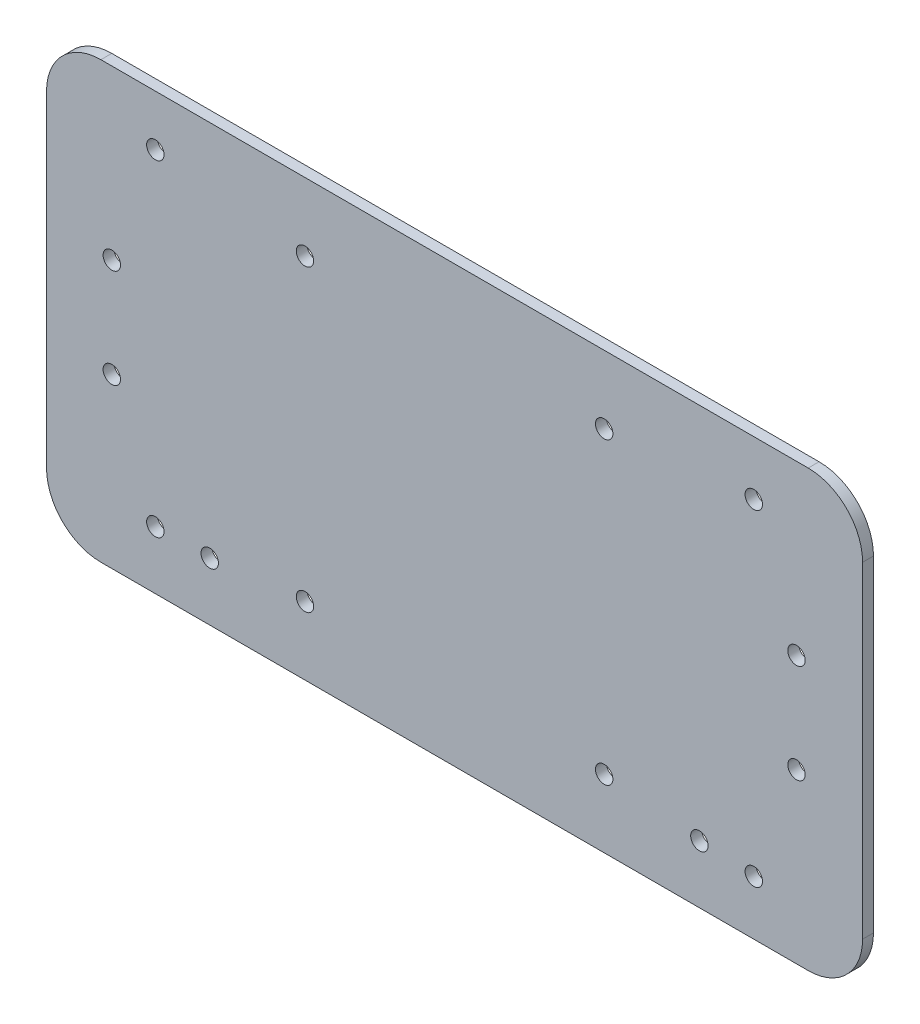
ISO-10303-21;
HEADER;
FILE_DESCRIPTION(('STEP AP214'),'2;1');
FILE_NAME('part.step','',(''),(''),'','','');
FILE_SCHEMA(('AUTOMOTIVE_DESIGN { 1 0 10303 214 1 1 1 1 }'));
ENDSEC;
DATA;
#1=APPLICATION_CONTEXT('core data for automotive mechanical design processes');
#2=APPLICATION_PROTOCOL_DEFINITION('international standard','automotive_design',2000,#1);
#3=PRODUCT_CONTEXT('',#1,'mechanical');
#4=PRODUCT('Part','Part','',(#3));
#5=PRODUCT_RELATED_PRODUCT_CATEGORY('part','',(#4));
#6=PRODUCT_DEFINITION_FORMATION('','',#4);
#7=PRODUCT_DEFINITION_CONTEXT('part definition',#1,'design');
#8=PRODUCT_DEFINITION('design','',#6,#7);
#9=PRODUCT_DEFINITION_SHAPE('','',#8);
#10=(LENGTH_UNIT() NAMED_UNIT(*) SI_UNIT(.MILLI.,.METRE.));
#11=(NAMED_UNIT(*) PLANE_ANGLE_UNIT() SI_UNIT($,.RADIAN.));
#12=(NAMED_UNIT(*) SI_UNIT($,.STERADIAN.) SOLID_ANGLE_UNIT());
#13=UNCERTAINTY_MEASURE_WITH_UNIT(LENGTH_MEASURE(1.E-05),#10,'distance_accuracy_value','');
#14=(GEOMETRIC_REPRESENTATION_CONTEXT(3) GLOBAL_UNCERTAINTY_ASSIGNED_CONTEXT((#13)) GLOBAL_UNIT_ASSIGNED_CONTEXT((#10,
#11,#12)) REPRESENTATION_CONTEXT('',''));
#15=CARTESIAN_POINT('',(0.,0.,0.));
#16=DIRECTION('',(0.,0.,1.));
#17=DIRECTION('',(1.,0.,0.));
#18=AXIS2_PLACEMENT_3D('',#15,#16,#17);
#19=CARTESIAN_POINT('',(75.,0.,2.));
#20=DIRECTION('',(-1.,0.,0.));
#21=DIRECTION('',(0.,-1.,0.));
#22=AXIS2_PLACEMENT_3D('',#19,#20,#21);
#23=PLANE('',#22);
#24=DIRECTION('',(0.,1.,0.));
#25=VECTOR('',#24,1.);
#26=CARTESIAN_POINT('',(75.,0.,0.));
#27=LINE('',#26,#25);
#28=CARTESIAN_POINT('',(75.,-29.9999999999999,0.));
#29=VERTEX_POINT('',#28);
#30=CARTESIAN_POINT('',(75.,29.9999999999999,0.));
#31=VERTEX_POINT('',#30);
#32=EDGE_CURVE('E179',#29,#31,#27,.T.);
#33=ORIENTED_EDGE('',*,*,#32,.T.);
#34=DIRECTION('',(0.,0.,-1.));
#35=VECTOR('',#34,1.);
#36=CARTESIAN_POINT('',(75.,29.9999999999999,2.));
#37=LINE('',#36,#35);
#38=CARTESIAN_POINT('',(75.,29.9999999999999,2.));
#39=VERTEX_POINT('',#38);
#40=EDGE_CURVE('E11',#39,#31,#37,.T.);
#41=ORIENTED_EDGE('',*,*,#40,.F.);
#42=DIRECTION('',(0.,1.,0.));
#43=VECTOR('',#42,1.);
#44=CARTESIAN_POINT('',(75.,0.,2.));
#45=LINE('',#44,#43);
#46=CARTESIAN_POINT('',(75.,-29.9999999999999,2.));
#47=VERTEX_POINT('',#46);
#48=EDGE_CURVE('E251',#47,#39,#45,.T.);
#49=ORIENTED_EDGE('',*,*,#48,.F.);
#50=DIRECTION('',(0.,0.,-1.));
#51=VECTOR('',#50,1.);
#52=CARTESIAN_POINT('',(75.,-29.9999999999999,2.));
#53=LINE('',#52,#51);
#54=EDGE_CURVE('E163',#47,#29,#53,.T.);
#55=ORIENTED_EDGE('',*,*,#54,.T.);
#56=EDGE_LOOP('',(#33,#41,#49,#55));
#57=FACE_BOUND('',#56,.T.);
#58=ADVANCED_FACE('F39',(#57),#23,.F.);
#59=CARTESIAN_POINT('',(65.,30.,2.));
#60=DIRECTION('',(0.,0.,-1.));
#61=DIRECTION('',(-1.,0.,0.));
#62=AXIS2_PLACEMENT_3D('',#59,#60,#61);
#63=CYLINDRICAL_SURFACE('',#62,10.);
#64=CARTESIAN_POINT('',(65.,30.,0.));
#65=DIRECTION('',(0.,0.,1.));
#66=DIRECTION('',(1.,0.,0.));
#67=AXIS2_PLACEMENT_3D('',#64,#65,#66);
#68=CIRCLE('',#67,10.);
#69=CARTESIAN_POINT('',(64.9999999999999,40.,0.));
#70=VERTEX_POINT('',#69);
#71=EDGE_CURVE('E182',#31,#70,#68,.T.);
#72=ORIENTED_EDGE('',*,*,#71,.T.);
#73=DIRECTION('',(0.,0.,-1.));
#74=VECTOR('',#73,1.);
#75=CARTESIAN_POINT('',(64.9999999999999,40.,2.));
#76=LINE('',#75,#74);
#77=CARTESIAN_POINT('',(64.9999999999999,40.,2.));
#78=VERTEX_POINT('',#77);
#79=EDGE_CURVE('E48',#78,#70,#76,.T.);
#80=ORIENTED_EDGE('',*,*,#79,.F.);
#81=CARTESIAN_POINT('',(65.,30.,2.));
#82=DIRECTION('',(0.,0.,1.));
#83=DIRECTION('',(1.,0.,0.));
#84=AXIS2_PLACEMENT_3D('',#81,#82,#83);
#85=CIRCLE('',#84,10.);
#86=EDGE_CURVE('E99',#39,#78,#85,.T.);
#87=ORIENTED_EDGE('',*,*,#86,.F.);
#88=ORIENTED_EDGE('',*,*,#40,.T.);
#89=EDGE_LOOP('',(#72,#80,#87,#88));
#90=FACE_BOUND('',#89,.T.);
#91=ADVANCED_FACE('F237',(#90),#63,.T.);
#92=CARTESIAN_POINT('',(0.,40.,2.));
#93=DIRECTION('',(0.,1.,0.));
#94=DIRECTION('',(0.,0.,1.));
#95=AXIS2_PLACEMENT_3D('',#92,#93,#94);
#96=PLANE('',#95);
#97=DIRECTION('',(1.,0.,0.));
#98=VECTOR('',#97,1.);
#99=CARTESIAN_POINT('',(0.,40.,0.));
#100=LINE('',#99,#98);
#101=CARTESIAN_POINT('',(-64.9999999999999,40.,0.));
#102=VERTEX_POINT('',#101);
#103=EDGE_CURVE('E185',#102,#70,#100,.T.);
#104=ORIENTED_EDGE('',*,*,#103,.F.);
#105=DIRECTION('',(0.,0.,-1.));
#106=VECTOR('',#105,1.);
#107=CARTESIAN_POINT('',(-64.9999999999999,40.,2.));
#108=LINE('',#107,#106);
#109=CARTESIAN_POINT('',(-64.9999999999999,40.,2.));
#110=VERTEX_POINT('',#109);
#111=EDGE_CURVE('E230',#110,#102,#108,.T.);
#112=ORIENTED_EDGE('',*,*,#111,.F.);
#113=DIRECTION('',(1.,0.,0.));
#114=VECTOR('',#113,1.);
#115=CARTESIAN_POINT('',(0.,40.,2.));
#116=LINE('',#115,#114);
#117=EDGE_CURVE('E236',#110,#78,#116,.T.);
#118=ORIENTED_EDGE('',*,*,#117,.T.);
#119=ORIENTED_EDGE('',*,*,#79,.T.);
#120=EDGE_LOOP('',(#104,#112,#118,#119));
#121=FACE_BOUND('',#120,.T.);
#122=ADVANCED_FACE('F234',(#121),#96,.T.);
#123=CARTESIAN_POINT('',(-65.,30.,2.));
#124=DIRECTION('',(0.,0.,-1.));
#125=DIRECTION('',(-1.,0.,0.));
#126=AXIS2_PLACEMENT_3D('',#123,#124,#125);
#127=CYLINDRICAL_SURFACE('',#126,10.);
#128=CARTESIAN_POINT('',(-65.,30.,0.));
#129=DIRECTION('',(0.,0.,1.));
#130=DIRECTION('',(1.,0.,0.));
#131=AXIS2_PLACEMENT_3D('',#128,#129,#130);
#132=CIRCLE('',#131,10.);
#133=CARTESIAN_POINT('',(-75.,29.9999999999999,0.));
#134=VERTEX_POINT('',#133);
#135=EDGE_CURVE('E188',#134,#102,#132,.F.);
#136=ORIENTED_EDGE('',*,*,#135,.F.);
#137=DIRECTION('',(0.,0.,-1.));
#138=VECTOR('',#137,1.);
#139=CARTESIAN_POINT('',(-75.,29.9999999999999,2.));
#140=LINE('',#139,#138);
#141=CARTESIAN_POINT('',(-75.,29.9999999999999,2.));
#142=VERTEX_POINT('',#141);
#143=EDGE_CURVE('E228',#142,#134,#140,.T.);
#144=ORIENTED_EDGE('',*,*,#143,.F.);
#145=CARTESIAN_POINT('',(-65.,30.,2.));
#146=DIRECTION('',(0.,0.,1.));
#147=DIRECTION('',(1.,0.,0.));
#148=AXIS2_PLACEMENT_3D('',#145,#146,#147);
#149=CIRCLE('',#148,10.);
#150=EDGE_CURVE('E248',#142,#110,#149,.F.);
#151=ORIENTED_EDGE('',*,*,#150,.T.);
#152=ORIENTED_EDGE('',*,*,#111,.T.);
#153=EDGE_LOOP('',(#136,#144,#151,#152));
#154=FACE_BOUND('',#153,.T.);
#155=ADVANCED_FACE('F246',(#154),#127,.T.);
#156=CARTESIAN_POINT('',(-75.,0.,2.));
#157=DIRECTION('',(-1.,0.,0.));
#158=DIRECTION('',(0.,0.,1.));
#159=AXIS2_PLACEMENT_3D('',#156,#157,#158);
#160=PLANE('',#159);
#161=DIRECTION('',(0.,1.,0.));
#162=VECTOR('',#161,1.);
#163=CARTESIAN_POINT('',(-75.,0.,0.));
#164=LINE('',#163,#162);
#165=CARTESIAN_POINT('',(-75.,-29.9999999999999,0.));
#166=VERTEX_POINT('',#165);
#167=EDGE_CURVE('E191',#166,#134,#164,.T.);
#168=ORIENTED_EDGE('',*,*,#167,.F.);
#169=DIRECTION('',(0.,0.,-1.));
#170=VECTOR('',#169,1.);
#171=CARTESIAN_POINT('',(-75.,-29.9999999999999,2.));
#172=LINE('',#171,#170);
#173=CARTESIAN_POINT('',(-75.,-29.9999999999999,2.));
#174=VERTEX_POINT('',#173);
#175=EDGE_CURVE('E128',#174,#166,#172,.T.);
#176=ORIENTED_EDGE('',*,*,#175,.F.);
#177=DIRECTION('',(0.,1.,0.));
#178=VECTOR('',#177,1.);
#179=CARTESIAN_POINT('',(-75.,0.,2.));
#180=LINE('',#179,#178);
#181=EDGE_CURVE('E121',#174,#142,#180,.T.);
#182=ORIENTED_EDGE('',*,*,#181,.T.);
#183=ORIENTED_EDGE('',*,*,#143,.T.);
#184=EDGE_LOOP('',(#168,#176,#182,#183));
#185=FACE_BOUND('',#184,.T.);
#186=ADVANCED_FACE('F255',(#185),#160,.T.);
#187=CARTESIAN_POINT('',(-65.,-30.,2.));
#188=DIRECTION('',(0.,0.,-1.));
#189=DIRECTION('',(-1.,0.,0.));
#190=AXIS2_PLACEMENT_3D('',#187,#188,#189);
#191=CYLINDRICAL_SURFACE('',#190,10.);
#192=CARTESIAN_POINT('',(-65.,-30.,0.));
#193=DIRECTION('',(0.,0.,1.));
#194=DIRECTION('',(1.,0.,0.));
#195=AXIS2_PLACEMENT_3D('',#192,#193,#194);
#196=CIRCLE('',#195,10.);
#197=CARTESIAN_POINT('',(-64.9999999999999,-40.,0.));
#198=VERTEX_POINT('',#197);
#199=EDGE_CURVE('E127',#166,#198,#196,.T.);
#200=ORIENTED_EDGE('',*,*,#199,.T.);
#201=DIRECTION('',(0.,0.,-1.));
#202=VECTOR('',#201,1.);
#203=CARTESIAN_POINT('',(-64.9999999999999,-40.,2.));
#204=LINE('',#203,#202);
#205=CARTESIAN_POINT('',(-64.9999999999999,-40.,2.));
#206=VERTEX_POINT('',#205);
#207=EDGE_CURVE('E124',#206,#198,#204,.T.);
#208=ORIENTED_EDGE('',*,*,#207,.F.);
#209=CARTESIAN_POINT('',(-65.,-30.,2.));
#210=DIRECTION('',(0.,0.,1.));
#211=DIRECTION('',(1.,0.,0.));
#212=AXIS2_PLACEMENT_3D('',#209,#210,#211);
#213=CIRCLE('',#212,10.);
#214=EDGE_CURVE('E113',#174,#206,#213,.T.);
#215=ORIENTED_EDGE('',*,*,#214,.F.);
#216=ORIENTED_EDGE('',*,*,#175,.T.);
#217=EDGE_LOOP('',(#200,#208,#215,#216));
#218=FACE_BOUND('',#217,.T.);
#219=ADVANCED_FACE('F125',(#218),#191,.T.);
#220=CARTESIAN_POINT('',(0.,-40.,2.));
#221=DIRECTION('',(0.,1.,0.));
#222=DIRECTION('',(0.,0.,1.));
#223=AXIS2_PLACEMENT_3D('',#220,#221,#222);
#224=PLANE('',#223);
#225=DIRECTION('',(1.,0.,0.));
#226=VECTOR('',#225,1.);
#227=CARTESIAN_POINT('',(0.,-40.,0.));
#228=LINE('',#227,#226);
#229=CARTESIAN_POINT('',(64.9999999999999,-40.,0.));
#230=VERTEX_POINT('',#229);
#231=EDGE_CURVE('E85',#198,#230,#228,.T.);
#232=ORIENTED_EDGE('',*,*,#231,.T.);
#233=DIRECTION('',(0.,0.,-1.));
#234=VECTOR('',#233,1.);
#235=CARTESIAN_POINT('',(64.9999999999999,-40.,2.));
#236=LINE('',#235,#234);
#237=CARTESIAN_POINT('',(64.9999999999999,-40.,2.));
#238=VERTEX_POINT('',#237);
#239=EDGE_CURVE('E129',#238,#230,#236,.T.);
#240=ORIENTED_EDGE('',*,*,#239,.F.);
#241=DIRECTION('',(1.,0.,0.));
#242=VECTOR('',#241,1.);
#243=CARTESIAN_POINT('',(0.,-40.,2.));
#244=LINE('',#243,#242);
#245=EDGE_CURVE('E118',#206,#238,#244,.T.);
#246=ORIENTED_EDGE('',*,*,#245,.F.);
#247=ORIENTED_EDGE('',*,*,#207,.T.);
#248=EDGE_LOOP('',(#232,#240,#246,#247));
#249=FACE_BOUND('',#248,.T.);
#250=ADVANCED_FACE('F131',(#249),#224,.F.);
#251=CARTESIAN_POINT('',(-55.,30.6666666666667,2.));
#252=DIRECTION('',(0.,0.,-1.));
#253=DIRECTION('',(-1.,0.,0.));
#254=AXIS2_PLACEMENT_3D('',#251,#252,#253);
#255=CYLINDRICAL_SURFACE('',#254,1.6);
#256=CARTESIAN_POINT('',(-55.,30.6666666666667,2.));
#257=DIRECTION('',(0.,0.,1.));
#258=DIRECTION('',(1.,0.,0.));
#259=AXIS2_PLACEMENT_3D('',#256,#257,#258);
#260=CIRCLE('',#259,1.6);
#261=CARTESIAN_POINT('',(-53.4,30.6666666666667,2.));
#262=VERTEX_POINT('',#261);
#263=EDGE_CURVE('E157',#262,#262,#260,.T.);
#264=ORIENTED_EDGE('',*,*,#263,.T.);
#265=EDGE_LOOP('',(#264));
#266=FACE_BOUND('',#265,.T.);
#267=CARTESIAN_POINT('',(-55.,30.6666666666667,0.));
#268=DIRECTION('',(0.,0.,1.));
#269=DIRECTION('',(1.,0.,0.));
#270=AXIS2_PLACEMENT_3D('',#267,#268,#269);
#271=CIRCLE('',#270,1.6);
#272=CARTESIAN_POINT('',(-53.4,30.6666666666667,0.));
#273=VERTEX_POINT('',#272);
#274=EDGE_CURVE('E218',#273,#273,#271,.T.);
#275=ORIENTED_EDGE('',*,*,#274,.F.);
#276=EDGE_LOOP('',(#275));
#277=FACE_BOUND('',#276,.T.);
#278=ADVANCED_FACE('F323',(#266,#277),#255,.F.);
#279=CARTESIAN_POINT('',(-55.,-29.3333333333333,2.));
#280=DIRECTION('',(0.,0.,-1.));
#281=DIRECTION('',(-1.,0.,0.));
#282=AXIS2_PLACEMENT_3D('',#279,#280,#281);
#283=CYLINDRICAL_SURFACE('',#282,1.6);
#284=CARTESIAN_POINT('',(-55.,-29.3333333333333,2.));
#285=DIRECTION('',(0.,0.,1.));
#286=DIRECTION('',(1.,0.,0.));
#287=AXIS2_PLACEMENT_3D('',#284,#285,#286);
#288=CIRCLE('',#287,1.6);
#289=CARTESIAN_POINT('',(-53.4,-29.3333333333333,2.));
#290=VERTEX_POINT('',#289);
#291=EDGE_CURVE('E154',#290,#290,#288,.T.);
#292=ORIENTED_EDGE('',*,*,#291,.T.);
#293=EDGE_LOOP('',(#292));
#294=FACE_BOUND('',#293,.T.);
#295=CARTESIAN_POINT('',(-55.,-29.3333333333333,0.));
#296=DIRECTION('',(0.,0.,1.));
#297=DIRECTION('',(1.,0.,0.));
#298=AXIS2_PLACEMENT_3D('',#295,#296,#297);
#299=CIRCLE('',#298,1.6);
#300=CARTESIAN_POINT('',(-53.4,-29.3333333333333,0.));
#301=VERTEX_POINT('',#300);
#302=EDGE_CURVE('E215',#301,#301,#299,.T.);
#303=ORIENTED_EDGE('',*,*,#302,.F.);
#304=EDGE_LOOP('',(#303));
#305=FACE_BOUND('',#304,.T.);
#306=ADVANCED_FACE('F326',(#294,#305),#283,.F.);
#307=CARTESIAN_POINT('',(-63.,-9.1,2.));
#308=DIRECTION('',(0.,0.,-1.));
#309=DIRECTION('',(-1.,0.,0.));
#310=AXIS2_PLACEMENT_3D('',#307,#308,#309);
#311=CYLINDRICAL_SURFACE('',#310,1.6);
#312=CARTESIAN_POINT('',(-63.,-9.1,2.));
#313=DIRECTION('',(0.,0.,1.));
#314=DIRECTION('',(1.,0.,0.));
#315=AXIS2_PLACEMENT_3D('',#312,#313,#314);
#316=CIRCLE('',#315,1.6);
#317=CARTESIAN_POINT('',(-61.4,-9.1,2.));
#318=VERTEX_POINT('',#317);
#319=EDGE_CURVE('E151',#318,#318,#316,.T.);
#320=ORIENTED_EDGE('',*,*,#319,.T.);
#321=EDGE_LOOP('',(#320));
#322=FACE_BOUND('',#321,.T.);
#323=CARTESIAN_POINT('',(-63.,-9.1,0.));
#324=DIRECTION('',(0.,0.,1.));
#325=DIRECTION('',(1.,0.,0.));
#326=AXIS2_PLACEMENT_3D('',#323,#324,#325);
#327=CIRCLE('',#326,1.6);
#328=CARTESIAN_POINT('',(-61.4,-9.1,0.));
#329=VERTEX_POINT('',#328);
#330=EDGE_CURVE('E212',#329,#329,#327,.T.);
#331=ORIENTED_EDGE('',*,*,#330,.F.);
#332=EDGE_LOOP('',(#331));
#333=FACE_BOUND('',#332,.T.);
#334=ADVANCED_FACE('F330',(#322,#333),#311,.F.);
#335=CARTESIAN_POINT('',(-63.,9.1,2.));
#336=DIRECTION('',(0.,0.,-1.));
#337=DIRECTION('',(-1.,0.,0.));
#338=AXIS2_PLACEMENT_3D('',#335,#336,#337);
#339=CYLINDRICAL_SURFACE('',#338,1.6);
#340=CARTESIAN_POINT('',(-63.,9.1,2.));
#341=DIRECTION('',(0.,0.,1.));
#342=DIRECTION('',(1.,0.,0.));
#343=AXIS2_PLACEMENT_3D('',#340,#341,#342);
#344=CIRCLE('',#343,1.6);
#345=CARTESIAN_POINT('',(-61.4,9.1,2.));
#346=VERTEX_POINT('',#345);
#347=EDGE_CURVE('E148',#346,#346,#344,.T.);
#348=ORIENTED_EDGE('',*,*,#347,.T.);
#349=EDGE_LOOP('',(#348));
#350=FACE_BOUND('',#349,.T.);
#351=CARTESIAN_POINT('',(-63.,9.1,0.));
#352=DIRECTION('',(0.,0.,1.));
#353=DIRECTION('',(1.,0.,0.));
#354=AXIS2_PLACEMENT_3D('',#351,#352,#353);
#355=CIRCLE('',#354,1.6);
#356=CARTESIAN_POINT('',(-61.4,9.1,0.));
#357=VERTEX_POINT('',#356);
#358=EDGE_CURVE('E209',#357,#357,#355,.T.);
#359=ORIENTED_EDGE('',*,*,#358,.F.);
#360=EDGE_LOOP('',(#359));
#361=FACE_BOUND('',#360,.T.);
#362=ADVANCED_FACE('F334',(#350,#361),#339,.F.);
#363=CARTESIAN_POINT('',(-27.5,-27.5,2.));
#364=DIRECTION('',(0.,0.,-1.));
#365=DIRECTION('',(-1.,0.,0.));
#366=AXIS2_PLACEMENT_3D('',#363,#364,#365);
#367=CYLINDRICAL_SURFACE('',#366,1.6);
#368=CARTESIAN_POINT('',(-27.5,-27.5,2.));
#369=DIRECTION('',(0.,0.,1.));
#370=DIRECTION('',(1.,0.,0.));
#371=AXIS2_PLACEMENT_3D('',#368,#369,#370);
#372=CIRCLE('',#371,1.6);
#373=CARTESIAN_POINT('',(-25.9,-27.5,2.));
#374=VERTEX_POINT('',#373);
#375=EDGE_CURVE('E145',#374,#374,#372,.T.);
#376=ORIENTED_EDGE('',*,*,#375,.T.);
#377=EDGE_LOOP('',(#376));
#378=FACE_BOUND('',#377,.T.);
#379=CARTESIAN_POINT('',(-27.5,-27.5,0.));
#380=DIRECTION('',(0.,0.,1.));
#381=DIRECTION('',(1.,0.,0.));
#382=AXIS2_PLACEMENT_3D('',#379,#380,#381);
#383=CIRCLE('',#382,1.6);
#384=CARTESIAN_POINT('',(-25.9,-27.5,0.));
#385=VERTEX_POINT('',#384);
#386=EDGE_CURVE('E206',#385,#385,#383,.T.);
#387=ORIENTED_EDGE('',*,*,#386,.F.);
#388=EDGE_LOOP('',(#387));
#389=FACE_BOUND('',#388,.T.);
#390=ADVANCED_FACE('F338',(#378,#389),#367,.F.);
#391=CARTESIAN_POINT('',(27.5,-27.5,2.));
#392=DIRECTION('',(0.,0.,-1.));
#393=DIRECTION('',(-1.,0.,0.));
#394=AXIS2_PLACEMENT_3D('',#391,#392,#393);
#395=CYLINDRICAL_SURFACE('',#394,1.6);
#396=CARTESIAN_POINT('',(27.5,-27.5,2.));
#397=DIRECTION('',(0.,0.,1.));
#398=DIRECTION('',(1.,0.,0.));
#399=AXIS2_PLACEMENT_3D('',#396,#397,#398);
#400=CIRCLE('',#399,1.6);
#401=CARTESIAN_POINT('',(29.1,-27.5,2.));
#402=VERTEX_POINT('',#401);
#403=EDGE_CURVE('E142',#402,#402,#400,.T.);
#404=ORIENTED_EDGE('',*,*,#403,.T.);
#405=EDGE_LOOP('',(#404));
#406=FACE_BOUND('',#405,.T.);
#407=CARTESIAN_POINT('',(27.5,-27.5,0.));
#408=DIRECTION('',(0.,0.,1.));
#409=DIRECTION('',(1.,0.,0.));
#410=AXIS2_PLACEMENT_3D('',#407,#408,#409);
#411=CIRCLE('',#410,1.6);
#412=CARTESIAN_POINT('',(29.1,-27.5,0.));
#413=VERTEX_POINT('',#412);
#414=EDGE_CURVE('E203',#413,#413,#411,.T.);
#415=ORIENTED_EDGE('',*,*,#414,.F.);
#416=EDGE_LOOP('',(#415));
#417=FACE_BOUND('',#416,.T.);
#418=ADVANCED_FACE('F342',(#406,#417),#395,.F.);
#419=CARTESIAN_POINT('',(-27.5,27.5,2.));
#420=DIRECTION('',(0.,0.,-1.));
#421=DIRECTION('',(-1.,0.,0.));
#422=AXIS2_PLACEMENT_3D('',#419,#420,#421);
#423=CYLINDRICAL_SURFACE('',#422,1.6);
#424=CARTESIAN_POINT('',(-27.5,27.5,2.));
#425=DIRECTION('',(0.,0.,1.));
#426=DIRECTION('',(1.,0.,0.));
#427=AXIS2_PLACEMENT_3D('',#424,#425,#426);
#428=CIRCLE('',#427,1.6);
#429=CARTESIAN_POINT('',(-25.9,27.5,2.));
#430=VERTEX_POINT('',#429);
#431=EDGE_CURVE('E139',#430,#430,#428,.T.);
#432=ORIENTED_EDGE('',*,*,#431,.T.);
#433=EDGE_LOOP('',(#432));
#434=FACE_BOUND('',#433,.T.);
#435=CARTESIAN_POINT('',(-27.5,27.5,0.));
#436=DIRECTION('',(0.,0.,1.));
#437=DIRECTION('',(1.,0.,0.));
#438=AXIS2_PLACEMENT_3D('',#435,#436,#437);
#439=CIRCLE('',#438,1.6);
#440=CARTESIAN_POINT('',(-25.9,27.5,0.));
#441=VERTEX_POINT('',#440);
#442=EDGE_CURVE('E200',#441,#441,#439,.T.);
#443=ORIENTED_EDGE('',*,*,#442,.F.);
#444=EDGE_LOOP('',(#443));
#445=FACE_BOUND('',#444,.T.);
#446=ADVANCED_FACE('F270',(#434,#445),#423,.F.);
#447=CARTESIAN_POINT('',(27.5,27.5,2.));
#448=DIRECTION('',(0.,0.,-1.));
#449=DIRECTION('',(-1.,0.,0.));
#450=AXIS2_PLACEMENT_3D('',#447,#448,#449);
#451=CYLINDRICAL_SURFACE('',#450,1.6);
#452=CARTESIAN_POINT('',(27.5,27.5,2.));
#453=DIRECTION('',(0.,0.,1.));
#454=DIRECTION('',(1.,0.,0.));
#455=AXIS2_PLACEMENT_3D('',#452,#453,#454);
#456=CIRCLE('',#455,1.6);
#457=CARTESIAN_POINT('',(29.1,27.5,2.));
#458=VERTEX_POINT('',#457);
#459=EDGE_CURVE('E133',#458,#458,#456,.T.);
#460=ORIENTED_EDGE('',*,*,#459,.T.);
#461=EDGE_LOOP('',(#460));
#462=FACE_BOUND('',#461,.T.);
#463=CARTESIAN_POINT('',(27.5,27.5,0.));
#464=DIRECTION('',(0.,0.,1.));
#465=DIRECTION('',(1.,0.,0.));
#466=AXIS2_PLACEMENT_3D('',#463,#464,#465);
#467=CIRCLE('',#466,1.6);
#468=CARTESIAN_POINT('',(29.1,27.5,0.));
#469=VERTEX_POINT('',#468);
#470=EDGE_CURVE('E197',#469,#469,#467,.T.);
#471=ORIENTED_EDGE('',*,*,#470,.F.);
#472=EDGE_LOOP('',(#471));
#473=FACE_BOUND('',#472,.T.);
#474=ADVANCED_FACE('F261',(#462,#473),#451,.F.);
#475=CARTESIAN_POINT('',(65.,-30.,2.));
#476=DIRECTION('',(0.,0.,-1.));
#477=DIRECTION('',(-1.,0.,0.));
#478=AXIS2_PLACEMENT_3D('',#475,#476,#477);
#479=CYLINDRICAL_SURFACE('',#478,10.);
#480=CARTESIAN_POINT('',(65.,-30.,0.));
#481=DIRECTION('',(0.,0.,1.));
#482=DIRECTION('',(1.,0.,0.));
#483=AXIS2_PLACEMENT_3D('',#480,#481,#482);
#484=CIRCLE('',#483,10.);
#485=EDGE_CURVE('E91',#230,#29,#484,.T.);
#486=ORIENTED_EDGE('',*,*,#485,.T.);
#487=ORIENTED_EDGE('',*,*,#54,.F.);
#488=CARTESIAN_POINT('',(65.,-30.,2.));
#489=DIRECTION('',(0.,0.,1.));
#490=DIRECTION('',(1.,0.,0.));
#491=AXIS2_PLACEMENT_3D('',#488,#489,#490);
#492=CIRCLE('',#491,10.);
#493=EDGE_CURVE('E56',#238,#47,#492,.T.);
#494=ORIENTED_EDGE('',*,*,#493,.F.);
#495=ORIENTED_EDGE('',*,*,#239,.T.);
#496=EDGE_LOOP('',(#486,#487,#494,#495));
#497=FACE_BOUND('',#496,.T.);
#498=ADVANCED_FACE('F258',(#497),#479,.T.);
#499=CARTESIAN_POINT('',(45.,-29.3333333333333,2.));
#500=DIRECTION('',(0.,0.,-1.));
#501=DIRECTION('',(-1.,0.,0.));
#502=AXIS2_PLACEMENT_3D('',#499,#500,#501);
#503=CYLINDRICAL_SURFACE('',#502,1.6);
#504=CARTESIAN_POINT('',(45.,-29.3333333333333,2.));
#505=DIRECTION('',(0.,0.,1.));
#506=DIRECTION('',(1.,0.,0.));
#507=AXIS2_PLACEMENT_3D('',#504,#505,#506);
#508=CIRCLE('',#507,1.6);
#509=CARTESIAN_POINT('',(46.6,-29.3333333333333,2.));
#510=VERTEX_POINT('',#509);
#511=EDGE_CURVE('E615',#510,#510,#508,.T.);
#512=ORIENTED_EDGE('',*,*,#511,.T.);
#513=EDGE_LOOP('',(#512));
#514=FACE_BOUND('',#513,.T.);
#515=CARTESIAN_POINT('',(45.,-29.3333333333333,0.));
#516=DIRECTION('',(0.,0.,1.));
#517=DIRECTION('',(1.,0.,0.));
#518=AXIS2_PLACEMENT_3D('',#515,#516,#517);
#519=CIRCLE('',#518,1.6);
#520=CARTESIAN_POINT('',(46.6,-29.3333333333333,0.));
#521=VERTEX_POINT('',#520);
#522=EDGE_CURVE('E176',#521,#521,#519,.T.);
#523=ORIENTED_EDGE('',*,*,#522,.F.);
#524=EDGE_LOOP('',(#523));
#525=FACE_BOUND('',#524,.T.);
#526=ADVANCED_FACE('F260',(#514,#525),#503,.F.);
#527=CARTESIAN_POINT('',(55.,-30.0000000000001,2.));
#528=DIRECTION('',(0.,0.,-1.));
#529=DIRECTION('',(-1.,0.,0.));
#530=AXIS2_PLACEMENT_3D('',#527,#528,#529);
#531=CYLINDRICAL_SURFACE('',#530,1.6);
#532=CARTESIAN_POINT('',(55.,-30.0000000000001,2.));
#533=DIRECTION('',(0.,0.,1.));
#534=DIRECTION('',(1.,0.,0.));
#535=AXIS2_PLACEMENT_3D('',#532,#533,#534);
#536=CIRCLE('',#535,1.6);
#537=CARTESIAN_POINT('',(56.6,-30.0000000000001,2.));
#538=VERTEX_POINT('',#537);
#539=EDGE_CURVE('E612',#538,#538,#536,.T.);
#540=ORIENTED_EDGE('',*,*,#539,.T.);
#541=EDGE_LOOP('',(#540));
#542=FACE_BOUND('',#541,.T.);
#543=CARTESIAN_POINT('',(55.,-30.0000000000001,0.));
#544=DIRECTION('',(0.,0.,1.));
#545=DIRECTION('',(1.,0.,0.));
#546=AXIS2_PLACEMENT_3D('',#543,#544,#545);
#547=CIRCLE('',#546,1.6);
#548=CARTESIAN_POINT('',(56.6,-30.0000000000001,0.));
#549=VERTEX_POINT('',#548);
#550=EDGE_CURVE('E173',#549,#549,#547,.T.);
#551=ORIENTED_EDGE('',*,*,#550,.F.);
#552=EDGE_LOOP('',(#551));
#553=FACE_BOUND('',#552,.T.);
#554=ADVANCED_FACE('F267',(#542,#553),#531,.F.);
#555=CARTESIAN_POINT('',(55.,29.9999999999999,2.));
#556=DIRECTION('',(0.,0.,-1.));
#557=DIRECTION('',(-1.,0.,0.));
#558=AXIS2_PLACEMENT_3D('',#555,#556,#557);
#559=CYLINDRICAL_SURFACE('',#558,1.6);
#560=CARTESIAN_POINT('',(55.,29.9999999999999,2.));
#561=DIRECTION('',(0.,0.,1.));
#562=DIRECTION('',(1.,0.,0.));
#563=AXIS2_PLACEMENT_3D('',#560,#561,#562);
#564=CIRCLE('',#563,1.6);
#565=CARTESIAN_POINT('',(56.6,29.9999999999999,2.));
#566=VERTEX_POINT('',#565);
#567=EDGE_CURVE('E608',#566,#566,#564,.T.);
#568=ORIENTED_EDGE('',*,*,#567,.T.);
#569=EDGE_LOOP('',(#568));
#570=FACE_BOUND('',#569,.T.);
#571=CARTESIAN_POINT('',(55.,29.9999999999999,0.));
#572=DIRECTION('',(0.,0.,1.));
#573=DIRECTION('',(1.,0.,0.));
#574=AXIS2_PLACEMENT_3D('',#571,#572,#573);
#575=CIRCLE('',#574,1.6);
#576=CARTESIAN_POINT('',(56.6,29.9999999999999,0.));
#577=VERTEX_POINT('',#576);
#578=EDGE_CURVE('E170',#577,#577,#575,.T.);
#579=ORIENTED_EDGE('',*,*,#578,.F.);
#580=EDGE_LOOP('',(#579));
#581=FACE_BOUND('',#580,.T.);
#582=ADVANCED_FACE('F284',(#570,#581),#559,.F.);
#583=CARTESIAN_POINT('',(62.85,-9.1,2.));
#584=DIRECTION('',(0.,0.,-1.));
#585=DIRECTION('',(-1.,0.,0.));
#586=AXIS2_PLACEMENT_3D('',#583,#584,#585);
#587=CYLINDRICAL_SURFACE('',#586,1.6);
#588=CARTESIAN_POINT('',(62.85,-9.1,2.));
#589=DIRECTION('',(0.,0.,1.));
#590=DIRECTION('',(1.,0.,0.));
#591=AXIS2_PLACEMENT_3D('',#588,#589,#590);
#592=CIRCLE('',#591,1.6);
#593=CARTESIAN_POINT('',(64.45,-9.1,2.));
#594=VERTEX_POINT('',#593);
#595=EDGE_CURVE('E299',#594,#594,#592,.T.);
#596=ORIENTED_EDGE('',*,*,#595,.T.);
#597=EDGE_LOOP('',(#596));
#598=FACE_BOUND('',#597,.T.);
#599=CARTESIAN_POINT('',(62.85,-9.1,0.));
#600=DIRECTION('',(0.,0.,1.));
#601=DIRECTION('',(1.,0.,0.));
#602=AXIS2_PLACEMENT_3D('',#599,#600,#601);
#603=CIRCLE('',#602,1.6);
#604=CARTESIAN_POINT('',(64.45,-9.1,0.));
#605=VERTEX_POINT('',#604);
#606=EDGE_CURVE('E167',#605,#605,#603,.T.);
#607=ORIENTED_EDGE('',*,*,#606,.F.);
#608=EDGE_LOOP('',(#607));
#609=FACE_BOUND('',#608,.T.);
#610=ADVANCED_FACE('F287',(#598,#609),#587,.F.);
#611=CARTESIAN_POINT('',(62.85,9.1,2.));
#612=DIRECTION('',(0.,0.,-1.));
#613=DIRECTION('',(-1.,0.,0.));
#614=AXIS2_PLACEMENT_3D('',#611,#612,#613);
#615=CYLINDRICAL_SURFACE('',#614,1.6);
#616=CARTESIAN_POINT('',(62.85,9.1,2.));
#617=DIRECTION('',(0.,0.,1.));
#618=DIRECTION('',(1.,0.,0.));
#619=AXIS2_PLACEMENT_3D('',#616,#617,#618);
#620=CIRCLE('',#619,1.6);
#621=CARTESIAN_POINT('',(64.45,9.1,2.));
#622=VERTEX_POINT('',#621);
#623=EDGE_CURVE('E224',#622,#622,#620,.T.);
#624=ORIENTED_EDGE('',*,*,#623,.T.);
#625=EDGE_LOOP('',(#624));
#626=FACE_BOUND('',#625,.T.);
#627=CARTESIAN_POINT('',(62.85,9.1,0.));
#628=DIRECTION('',(0.,0.,1.));
#629=DIRECTION('',(1.,0.,0.));
#630=AXIS2_PLACEMENT_3D('',#627,#628,#629);
#631=CIRCLE('',#630,1.6);
#632=CARTESIAN_POINT('',(64.45,9.1,0.));
#633=VERTEX_POINT('',#632);
#634=EDGE_CURVE('E164',#633,#633,#631,.T.);
#635=ORIENTED_EDGE('',*,*,#634,.F.);
#636=EDGE_LOOP('',(#635));
#637=FACE_BOUND('',#636,.T.);
#638=ADVANCED_FACE('F41',(#626,#637),#615,.F.);
#639=CARTESIAN_POINT('',(-45.,-29.3333333333333,2.));
#640=DIRECTION('',(0.,0.,-1.));
#641=DIRECTION('',(-1.,0.,0.));
#642=AXIS2_PLACEMENT_3D('',#639,#640,#641);
#643=CYLINDRICAL_SURFACE('',#642,1.6);
#644=CARTESIAN_POINT('',(-45.,-29.3333333333333,2.));
#645=DIRECTION('',(0.,0.,1.));
#646=DIRECTION('',(1.,0.,0.));
#647=AXIS2_PLACEMENT_3D('',#644,#645,#646);
#648=CIRCLE('',#647,1.6);
#649=CARTESIAN_POINT('',(-43.4,-29.3333333333333,2.));
#650=VERTEX_POINT('',#649);
#651=EDGE_CURVE('E160',#650,#650,#648,.T.);
#652=ORIENTED_EDGE('',*,*,#651,.T.);
#653=EDGE_LOOP('',(#652));
#654=FACE_BOUND('',#653,.T.);
#655=CARTESIAN_POINT('',(-45.,-29.3333333333333,0.));
#656=DIRECTION('',(0.,0.,1.));
#657=DIRECTION('',(1.,0.,0.));
#658=AXIS2_PLACEMENT_3D('',#655,#656,#657);
#659=CIRCLE('',#658,1.6);
#660=CARTESIAN_POINT('',(-43.4,-29.3333333333333,0.));
#661=VERTEX_POINT('',#660);
#662=EDGE_CURVE('E221',#661,#661,#659,.T.);
#663=ORIENTED_EDGE('',*,*,#662,.F.);
#664=EDGE_LOOP('',(#663));
#665=FACE_BOUND('',#664,.T.);
#666=ADVANCED_FACE('F294',(#654,#665),#643,.F.);
#667=CARTESIAN_POINT('',(0.,0.,2.));
#668=DIRECTION('',(0.,0.,1.));
#669=DIRECTION('',(1.,0.,0.));
#670=AXIS2_PLACEMENT_3D('',#667,#668,#669);
#671=PLANE('',#670);
#672=ORIENTED_EDGE('',*,*,#623,.F.);
#673=EDGE_LOOP('',(#672));
#674=FACE_BOUND('',#673,.T.);
#675=ORIENTED_EDGE('',*,*,#595,.F.);
#676=EDGE_LOOP('',(#675));
#677=FACE_BOUND('',#676,.T.);
#678=ORIENTED_EDGE('',*,*,#567,.F.);
#679=EDGE_LOOP('',(#678));
#680=FACE_BOUND('',#679,.T.);
#681=ORIENTED_EDGE('',*,*,#539,.F.);
#682=EDGE_LOOP('',(#681));
#683=FACE_BOUND('',#682,.T.);
#684=ORIENTED_EDGE('',*,*,#511,.F.);
#685=EDGE_LOOP('',(#684));
#686=FACE_BOUND('',#685,.T.);
#687=ORIENTED_EDGE('',*,*,#48,.T.);
#688=ORIENTED_EDGE('',*,*,#86,.T.);
#689=ORIENTED_EDGE('',*,*,#117,.F.);
#690=ORIENTED_EDGE('',*,*,#150,.F.);
#691=ORIENTED_EDGE('',*,*,#181,.F.);
#692=ORIENTED_EDGE('',*,*,#214,.T.);
#693=ORIENTED_EDGE('',*,*,#245,.T.);
#694=ORIENTED_EDGE('',*,*,#493,.T.);
#695=EDGE_LOOP('',(#687,#688,#689,#690,#691,#692,#693,#694));
#696=FACE_BOUND('',#695,.T.);
#697=ORIENTED_EDGE('',*,*,#459,.F.);
#698=EDGE_LOOP('',(#697));
#699=FACE_BOUND('',#698,.T.);
#700=ORIENTED_EDGE('',*,*,#431,.F.);
#701=EDGE_LOOP('',(#700));
#702=FACE_BOUND('',#701,.T.);
#703=ORIENTED_EDGE('',*,*,#403,.F.);
#704=EDGE_LOOP('',(#703));
#705=FACE_BOUND('',#704,.T.);
#706=ORIENTED_EDGE('',*,*,#375,.F.);
#707=EDGE_LOOP('',(#706));
#708=FACE_BOUND('',#707,.T.);
#709=ORIENTED_EDGE('',*,*,#347,.F.);
#710=EDGE_LOOP('',(#709));
#711=FACE_BOUND('',#710,.T.);
#712=ORIENTED_EDGE('',*,*,#319,.F.);
#713=EDGE_LOOP('',(#712));
#714=FACE_BOUND('',#713,.T.);
#715=ORIENTED_EDGE('',*,*,#291,.F.);
#716=EDGE_LOOP('',(#715));
#717=FACE_BOUND('',#716,.T.);
#718=ORIENTED_EDGE('',*,*,#263,.F.);
#719=EDGE_LOOP('',(#718));
#720=FACE_BOUND('',#719,.T.);
#721=ORIENTED_EDGE('',*,*,#651,.F.);
#722=EDGE_LOOP('',(#721));
#723=FACE_BOUND('',#722,.T.);
#724=ADVANCED_FACE('F115',(#674,#677,#680,#683,#686,#696,#699,#702,#705,#708,#711,#714,#717,
#720,#723),#671,.T.);
#725=CARTESIAN_POINT('',(0.,0.,0.));
#726=DIRECTION('',(0.,0.,1.));
#727=DIRECTION('',(1.,0.,0.));
#728=AXIS2_PLACEMENT_3D('',#725,#726,#727);
#729=PLANE('',#728);
#730=ORIENTED_EDGE('',*,*,#634,.T.);
#731=EDGE_LOOP('',(#730));
#732=FACE_BOUND('',#731,.T.);
#733=ORIENTED_EDGE('',*,*,#606,.T.);
#734=EDGE_LOOP('',(#733));
#735=FACE_BOUND('',#734,.T.);
#736=ORIENTED_EDGE('',*,*,#578,.T.);
#737=EDGE_LOOP('',(#736));
#738=FACE_BOUND('',#737,.T.);
#739=ORIENTED_EDGE('',*,*,#550,.T.);
#740=EDGE_LOOP('',(#739));
#741=FACE_BOUND('',#740,.T.);
#742=ORIENTED_EDGE('',*,*,#522,.T.);
#743=EDGE_LOOP('',(#742));
#744=FACE_BOUND('',#743,.T.);
#745=ORIENTED_EDGE('',*,*,#32,.F.);
#746=ORIENTED_EDGE('',*,*,#485,.F.);
#747=ORIENTED_EDGE('',*,*,#231,.F.);
#748=ORIENTED_EDGE('',*,*,#199,.F.);
#749=ORIENTED_EDGE('',*,*,#167,.T.);
#750=ORIENTED_EDGE('',*,*,#135,.T.);
#751=ORIENTED_EDGE('',*,*,#103,.T.);
#752=ORIENTED_EDGE('',*,*,#71,.F.);
#753=EDGE_LOOP('',(#745,#746,#747,#748,#749,#750,#751,#752));
#754=FACE_BOUND('',#753,.T.);
#755=ORIENTED_EDGE('',*,*,#470,.T.);
#756=EDGE_LOOP('',(#755));
#757=FACE_BOUND('',#756,.T.);
#758=ORIENTED_EDGE('',*,*,#442,.T.);
#759=EDGE_LOOP('',(#758));
#760=FACE_BOUND('',#759,.T.);
#761=ORIENTED_EDGE('',*,*,#414,.T.);
#762=EDGE_LOOP('',(#761));
#763=FACE_BOUND('',#762,.T.);
#764=ORIENTED_EDGE('',*,*,#386,.T.);
#765=EDGE_LOOP('',(#764));
#766=FACE_BOUND('',#765,.T.);
#767=ORIENTED_EDGE('',*,*,#358,.T.);
#768=EDGE_LOOP('',(#767));
#769=FACE_BOUND('',#768,.T.);
#770=ORIENTED_EDGE('',*,*,#330,.T.);
#771=EDGE_LOOP('',(#770));
#772=FACE_BOUND('',#771,.T.);
#773=ORIENTED_EDGE('',*,*,#302,.T.);
#774=EDGE_LOOP('',(#773));
#775=FACE_BOUND('',#774,.T.);
#776=ORIENTED_EDGE('',*,*,#274,.T.);
#777=EDGE_LOOP('',(#776));
#778=FACE_BOUND('',#777,.T.);
#779=ORIENTED_EDGE('',*,*,#662,.T.);
#780=EDGE_LOOP('',(#779));
#781=FACE_BOUND('',#780,.T.);
#782=ADVANCED_FACE('F241',(#732,#735,#738,#741,#744,#754,#757,#760,#763,#766,#769,#772,#775,
#778,#781),#729,.F.);
#783=CLOSED_SHELL('',(#58,#91,#122,#155,#186,#219,#250,#278,#306,#334,#362,#390,#418,#446,#474,
#498,#526,#554,#582,#610,#638,#666,#724,#782));
#784=MANIFOLD_SOLID_BREP('B2',#783);
#785=ADVANCED_BREP_SHAPE_REPRESENTATION('',(#18,#784),#14);
#786=SHAPE_DEFINITION_REPRESENTATION(#9,#785);
ENDSEC;
END-ISO-10303-21;
